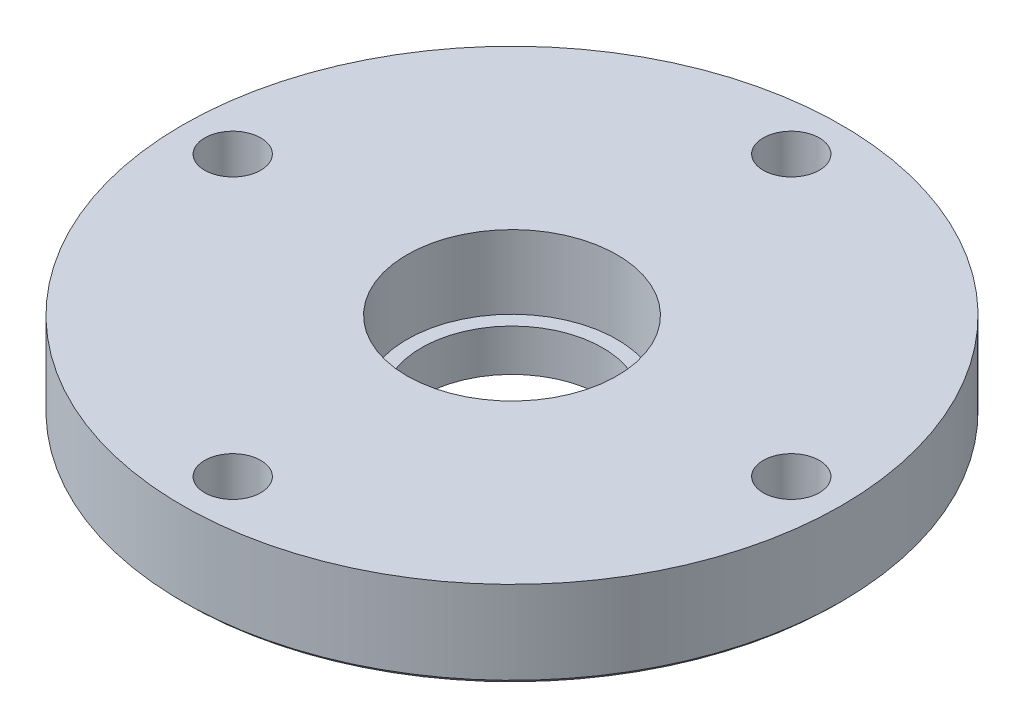
ISO-10303-21;
HEADER;
FILE_DESCRIPTION(('STEP AP214'),'2;1');
FILE_NAME('part.step','',(''),(''),'','','');
FILE_SCHEMA(('AUTOMOTIVE_DESIGN { 1 0 10303 214 1 1 1 1 }'));
ENDSEC;
DATA;
#1=APPLICATION_CONTEXT('core data for automotive mechanical design processes');
#2=APPLICATION_PROTOCOL_DEFINITION('international standard','automotive_design',2000,#1);
#3=PRODUCT_CONTEXT('',#1,'mechanical');
#4=PRODUCT('Part','Part','',(#3));
#5=PRODUCT_RELATED_PRODUCT_CATEGORY('part','',(#4));
#6=PRODUCT_DEFINITION_FORMATION('','',#4);
#7=PRODUCT_DEFINITION_CONTEXT('part definition',#1,'design');
#8=PRODUCT_DEFINITION('design','',#6,#7);
#9=PRODUCT_DEFINITION_SHAPE('','',#8);
#10=(LENGTH_UNIT() NAMED_UNIT(*) SI_UNIT(.MILLI.,.METRE.));
#11=(NAMED_UNIT(*) PLANE_ANGLE_UNIT() SI_UNIT($,.RADIAN.));
#12=(NAMED_UNIT(*) SI_UNIT($,.STERADIAN.) SOLID_ANGLE_UNIT());
#13=UNCERTAINTY_MEASURE_WITH_UNIT(LENGTH_MEASURE(1.E-05),#10,'distance_accuracy_value','');
#14=(GEOMETRIC_REPRESENTATION_CONTEXT(3) GLOBAL_UNCERTAINTY_ASSIGNED_CONTEXT((#13)) GLOBAL_UNIT_ASSIGNED_CONTEXT((#10,
#11,#12)) REPRESENTATION_CONTEXT('',''));
#15=CARTESIAN_POINT('',(0.,0.,0.));
#16=DIRECTION('',(0.,0.,1.));
#17=DIRECTION('',(1.,0.,0.));
#18=AXIS2_PLACEMENT_3D('',#15,#16,#17);
#19=CARTESIAN_POINT('',(0.,0.381000000000019,0.));
#20=DIRECTION('',(0.,1.,0.));
#21=DIRECTION('',(-1.,0.,0.));
#22=AXIS2_PLACEMENT_3D('',#19,#20,#21);
#23=CONICAL_SURFACE('',#22,29.972,0.78539816339745);
#24=CARTESIAN_POINT('',(0.,0.,0.));
#25=DIRECTION('',(0.,1.,0.));
#26=DIRECTION('',(-1.,0.,0.));
#27=AXIS2_PLACEMENT_3D('',#24,#25,#26);
#28=CIRCLE('',#27,29.5909999999999);
#29=CARTESIAN_POINT('',(-29.5909999999999,0.,0.));
#30=VERTEX_POINT('',#29);
#31=EDGE_CURVE('E39',#30,#30,#28,.T.);
#32=ORIENTED_EDGE('',*,*,#31,.T.);
#33=EDGE_LOOP('',(#32));
#34=FACE_BOUND('',#33,.T.);
#35=CARTESIAN_POINT('',(0.,0.381000000000019,0.));
#36=DIRECTION('',(0.,1.,0.));
#37=DIRECTION('',(-1.,0.,0.));
#38=AXIS2_PLACEMENT_3D('',#35,#36,#37);
#39=CIRCLE('',#38,29.972);
#40=CARTESIAN_POINT('',(-29.972,0.381000000000019,0.));
#41=VERTEX_POINT('',#40);
#42=EDGE_CURVE('E49',#41,#41,#39,.T.);
#43=ORIENTED_EDGE('',*,*,#42,.F.);
#44=EDGE_LOOP('',(#43));
#45=FACE_BOUND('',#44,.T.);
#46=ADVANCED_FACE('F32',(#34,#45),#23,.T.);
#47=CARTESIAN_POINT('',(29.5909999999999,0.,0.));
#48=DIRECTION('',(0.,-1.,0.));
#49=DIRECTION('',(1.,0.,0.));
#50=AXIS2_PLACEMENT_3D('',#47,#48,#49);
#51=PLANE('',#50);
#52=CARTESIAN_POINT('',(0.,0.,-25.4));
#53=DIRECTION('',(0.,-1.,0.));
#54=DIRECTION('',(1.,0.,0.));
#55=AXIS2_PLACEMENT_3D('',#52,#53,#54);
#56=CIRCLE('',#55,2.55270000000001);
#57=CARTESIAN_POINT('',(2.55270000000001,0.,-25.4));
#58=VERTEX_POINT('',#57);
#59=EDGE_CURVE('E87',#58,#58,#56,.T.);
#60=ORIENTED_EDGE('',*,*,#59,.F.);
#61=EDGE_LOOP('',(#60));
#62=FACE_BOUND('',#61,.T.);
#63=CARTESIAN_POINT('',(25.4,0.,0.));
#64=DIRECTION('',(0.,-1.,0.));
#65=DIRECTION('',(1.,0.,0.));
#66=AXIS2_PLACEMENT_3D('',#63,#64,#65);
#67=CIRCLE('',#66,2.55270000000001);
#68=CARTESIAN_POINT('',(27.9527,0.,0.));
#69=VERTEX_POINT('',#68);
#70=EDGE_CURVE('E35',#69,#69,#67,.T.);
#71=ORIENTED_EDGE('',*,*,#70,.F.);
#72=EDGE_LOOP('',(#71));
#73=FACE_BOUND('',#72,.T.);
#74=CARTESIAN_POINT('',(-25.4,0.,0.));
#75=DIRECTION('',(0.,-1.,0.));
#76=DIRECTION('',(1.,0.,0.));
#77=AXIS2_PLACEMENT_3D('',#74,#75,#76);
#78=CIRCLE('',#77,2.55270000000001);
#79=CARTESIAN_POINT('',(-22.8473,0.,0.));
#80=VERTEX_POINT('',#79);
#81=EDGE_CURVE('E94',#80,#80,#78,.T.);
#82=ORIENTED_EDGE('',*,*,#81,.F.);
#83=EDGE_LOOP('',(#82));
#84=FACE_BOUND('',#83,.T.);
#85=CARTESIAN_POINT('',(0.,0.,25.4));
#86=DIRECTION('',(0.,-1.,0.));
#87=DIRECTION('',(0.,0.,-1.));
#88=AXIS2_PLACEMENT_3D('',#85,#86,#87);
#89=CIRCLE('',#88,2.55270000000001);
#90=CARTESIAN_POINT('',(0.,0.,22.8473));
#91=VERTEX_POINT('',#90);
#92=EDGE_CURVE('E98',#91,#91,#89,.T.);
#93=ORIENTED_EDGE('',*,*,#92,.F.);
#94=EDGE_LOOP('',(#93));
#95=FACE_BOUND('',#94,.T.);
#96=CARTESIAN_POINT('',(0.,0.,0.));
#97=DIRECTION('',(0.,-1.,0.));
#98=DIRECTION('',(1.,0.,0.));
#99=AXIS2_PLACEMENT_3D('',#96,#97,#98);
#100=CIRCLE('',#99,9.50595);
#101=CARTESIAN_POINT('',(9.50595,0.,0.));
#102=VERTEX_POINT('',#101);
#103=EDGE_CURVE('E10',#102,#102,#100,.T.);
#104=ORIENTED_EDGE('',*,*,#103,.F.);
#105=EDGE_LOOP('',(#104));
#106=FACE_BOUND('',#105,.T.);
#107=ORIENTED_EDGE('',*,*,#31,.F.);
#108=EDGE_LOOP('',(#107));
#109=FACE_BOUND('',#108,.T.);
#110=ADVANCED_FACE('F69',(#62,#73,#84,#95,#106,#109),#51,.T.);
#111=CARTESIAN_POINT('',(0.,7.9375,0.));
#112=DIRECTION('',(0.,1.,0.));
#113=DIRECTION('',(-1.,0.,0.));
#114=AXIS2_PLACEMENT_3D('',#111,#112,#113);
#115=PLANE('',#114);
#116=CARTESIAN_POINT('',(0.,7.9375,0.));
#117=DIRECTION('',(0.,1.,0.));
#118=DIRECTION('',(0.,0.,1.));
#119=AXIS2_PLACEMENT_3D('',#116,#117,#118);
#120=CIRCLE('',#119,9.5504);
#121=CARTESIAN_POINT('',(0.,7.9375,9.5504));
#122=VERTEX_POINT('',#121);
#123=EDGE_CURVE('E159',#122,#122,#120,.T.);
#124=ORIENTED_EDGE('',*,*,#123,.F.);
#125=EDGE_LOOP('',(#124));
#126=FACE_BOUND('',#125,.T.);
#127=CARTESIAN_POINT('',(0.,7.9375,-25.4));
#128=DIRECTION('',(0.,1.,0.));
#129=DIRECTION('',(0.,0.,1.));
#130=AXIS2_PLACEMENT_3D('',#127,#128,#129);
#131=CIRCLE('',#130,2.55270000000001);
#132=CARTESIAN_POINT('',(0.,7.9375,-22.8473));
#133=VERTEX_POINT('',#132);
#134=EDGE_CURVE('E169',#133,#133,#131,.T.);
#135=ORIENTED_EDGE('',*,*,#134,.F.);
#136=EDGE_LOOP('',(#135));
#137=FACE_BOUND('',#136,.T.);
#138=CARTESIAN_POINT('',(25.4,7.9375,0.));
#139=DIRECTION('',(0.,1.,0.));
#140=DIRECTION('',(0.,0.,1.));
#141=AXIS2_PLACEMENT_3D('',#138,#139,#140);
#142=CIRCLE('',#141,2.55270000000001);
#143=CARTESIAN_POINT('',(25.4,7.9375,2.55270000000001));
#144=VERTEX_POINT('',#143);
#145=EDGE_CURVE('E173',#144,#144,#142,.T.);
#146=ORIENTED_EDGE('',*,*,#145,.F.);
#147=EDGE_LOOP('',(#146));
#148=FACE_BOUND('',#147,.T.);
#149=CARTESIAN_POINT('',(-25.4,7.9375,0.));
#150=DIRECTION('',(0.,1.,0.));
#151=DIRECTION('',(0.,0.,1.));
#152=AXIS2_PLACEMENT_3D('',#149,#150,#151);
#153=CIRCLE('',#152,2.55270000000001);
#154=CARTESIAN_POINT('',(-25.4,7.9375,2.55270000000001));
#155=VERTEX_POINT('',#154);
#156=EDGE_CURVE('E105',#155,#155,#153,.T.);
#157=ORIENTED_EDGE('',*,*,#156,.F.);
#158=EDGE_LOOP('',(#157));
#159=FACE_BOUND('',#158,.T.);
#160=CARTESIAN_POINT('',(0.,7.9375,25.4));
#161=DIRECTION('',(0.,-1.,0.));
#162=DIRECTION('',(0.,0.,-1.));
#163=AXIS2_PLACEMENT_3D('',#160,#161,#162);
#164=CIRCLE('',#163,2.55270000000001);
#165=CARTESIAN_POINT('',(0.,7.9375,22.8473));
#166=VERTEX_POINT('',#165);
#167=EDGE_CURVE('E100',#166,#166,#164,.T.);
#168=ORIENTED_EDGE('',*,*,#167,.T.);
#169=EDGE_LOOP('',(#168));
#170=FACE_BOUND('',#169,.T.);
#171=CARTESIAN_POINT('',(0.,7.9375,0.));
#172=DIRECTION('',(0.,1.,0.));
#173=DIRECTION('',(-1.,0.,0.));
#174=AXIS2_PLACEMENT_3D('',#171,#172,#173);
#175=CIRCLE('',#174,29.972);
#176=CARTESIAN_POINT('',(-29.972,7.9375,0.));
#177=VERTEX_POINT('',#176);
#178=EDGE_CURVE('E44',#177,#177,#175,.T.);
#179=ORIENTED_EDGE('',*,*,#178,.T.);
#180=EDGE_LOOP('',(#179));
#181=FACE_BOUND('',#180,.T.);
#182=ADVANCED_FACE('F55',(#126,#137,#148,#159,#170,#181),#115,.T.);
#183=CARTESIAN_POINT('',(0.,0.,0.));
#184=DIRECTION('',(0.,1.,0.));
#185=DIRECTION('',(-1.,0.,0.));
#186=AXIS2_PLACEMENT_3D('',#183,#184,#185);
#187=CYLINDRICAL_SURFACE('',#186,29.972);
#188=ORIENTED_EDGE('',*,*,#42,.T.);
#189=EDGE_LOOP('',(#188));
#190=FACE_BOUND('',#189,.T.);
#191=ORIENTED_EDGE('',*,*,#178,.F.);
#192=EDGE_LOOP('',(#191));
#193=FACE_BOUND('',#192,.T.);
#194=ADVANCED_FACE('F57',(#190,#193),#187,.T.);
#195=CARTESIAN_POINT('',(0.,-2.159,0.));
#196=DIRECTION('',(0.,1.,0.));
#197=DIRECTION('',(-1.,0.,0.));
#198=AXIS2_PLACEMENT_3D('',#195,#196,#197);
#199=CYLINDRICAL_SURFACE('',#198,9.50595);
#200=CARTESIAN_POINT('',(0.,-2.159,0.));
#201=DIRECTION('',(0.,-1.,0.));
#202=DIRECTION('',(1.,0.,0.));
#203=AXIS2_PLACEMENT_3D('',#200,#201,#202);
#204=CIRCLE('',#203,9.50595);
#205=CARTESIAN_POINT('',(9.50595,-2.159,0.));
#206=VERTEX_POINT('',#205);
#207=EDGE_CURVE('E47',#206,#206,#204,.T.);
#208=ORIENTED_EDGE('',*,*,#207,.F.);
#209=EDGE_LOOP('',(#208));
#210=FACE_BOUND('',#209,.T.);
#211=ORIENTED_EDGE('',*,*,#103,.T.);
#212=EDGE_LOOP('',(#211));
#213=FACE_BOUND('',#212,.T.);
#214=ADVANCED_FACE('F59',(#210,#213),#199,.T.);
#215=CARTESIAN_POINT('',(0.,-2.159,0.));
#216=DIRECTION('',(0.,1.,0.));
#217=DIRECTION('',(1.,0.,0.));
#218=AXIS2_PLACEMENT_3D('',#215,#216,#217);
#219=CONICAL_SURFACE('',#218,9.50595,0.785398163397443);
#220=CARTESIAN_POINT('',(0.,-2.54,0.));
#221=DIRECTION('',(0.,-1.,0.));
#222=DIRECTION('',(1.,0.,0.));
#223=AXIS2_PLACEMENT_3D('',#220,#221,#222);
#224=CIRCLE('',#223,9.12495000000001);
#225=CARTESIAN_POINT('',(9.12495000000001,-2.54,0.));
#226=VERTEX_POINT('',#225);
#227=EDGE_CURVE('E103',#226,#226,#224,.T.);
#228=ORIENTED_EDGE('',*,*,#227,.F.);
#229=EDGE_LOOP('',(#228));
#230=FACE_BOUND('',#229,.T.);
#231=ORIENTED_EDGE('',*,*,#207,.T.);
#232=EDGE_LOOP('',(#231));
#233=FACE_BOUND('',#232,.T.);
#234=ADVANCED_FACE('F66',(#230,#233),#219,.T.);
#235=CARTESIAN_POINT('',(0.,-2.54,0.));
#236=DIRECTION('',(0.,-1.,0.));
#237=DIRECTION('',(1.,0.,0.));
#238=AXIS2_PLACEMENT_3D('',#235,#236,#237);
#239=PLANE('',#238);
#240=CARTESIAN_POINT('',(0.,-2.54,0.));
#241=DIRECTION('',(0.,1.,0.));
#242=DIRECTION('',(0.,0.,1.));
#243=AXIS2_PLACEMENT_3D('',#240,#241,#242);
#244=CIRCLE('',#243,8.23595000000001);
#245=CARTESIAN_POINT('',(0.,-2.54,8.23595000000001));
#246=VERTEX_POINT('',#245);
#247=EDGE_CURVE('E166',#246,#246,#244,.T.);
#248=ORIENTED_EDGE('',*,*,#247,.T.);
#249=EDGE_LOOP('',(#248));
#250=FACE_BOUND('',#249,.T.);
#251=ORIENTED_EDGE('',*,*,#227,.T.);
#252=EDGE_LOOP('',(#251));
#253=FACE_BOUND('',#252,.T.);
#254=ADVANCED_FACE('F115',(#250,#253),#239,.T.);
#255=CARTESIAN_POINT('',(0.,0.,25.4));
#256=DIRECTION('',(0.,-1.,0.));
#257=DIRECTION('',(0.,0.,-1.));
#258=AXIS2_PLACEMENT_3D('',#255,#256,#257);
#259=CYLINDRICAL_SURFACE('',#258,2.55270000000001);
#260=ORIENTED_EDGE('',*,*,#167,.F.);
#261=EDGE_LOOP('',(#260));
#262=FACE_BOUND('',#261,.T.);
#263=ORIENTED_EDGE('',*,*,#92,.T.);
#264=EDGE_LOOP('',(#263));
#265=FACE_BOUND('',#264,.T.);
#266=ADVANCED_FACE('F121',(#262,#265),#259,.F.);
#267=CARTESIAN_POINT('',(-25.4,7.9375,0.));
#268=DIRECTION('',(0.,1.,0.));
#269=DIRECTION('',(0.,0.,1.));
#270=AXIS2_PLACEMENT_3D('',#267,#268,#269);
#271=CYLINDRICAL_SURFACE('',#270,2.55270000000001);
#272=ORIENTED_EDGE('',*,*,#81,.T.);
#273=EDGE_LOOP('',(#272));
#274=FACE_BOUND('',#273,.T.);
#275=ORIENTED_EDGE('',*,*,#156,.T.);
#276=EDGE_LOOP('',(#275));
#277=FACE_BOUND('',#276,.T.);
#278=ADVANCED_FACE('F127',(#274,#277),#271,.F.);
#279=CARTESIAN_POINT('',(25.4,7.9375,0.));
#280=DIRECTION('',(0.,1.,0.));
#281=DIRECTION('',(0.,0.,1.));
#282=AXIS2_PLACEMENT_3D('',#279,#280,#281);
#283=CYLINDRICAL_SURFACE('',#282,2.55270000000001);
#284=ORIENTED_EDGE('',*,*,#70,.T.);
#285=EDGE_LOOP('',(#284));
#286=FACE_BOUND('',#285,.T.);
#287=ORIENTED_EDGE('',*,*,#145,.T.);
#288=EDGE_LOOP('',(#287));
#289=FACE_BOUND('',#288,.T.);
#290=ADVANCED_FACE('F131',(#286,#289),#283,.F.);
#291=CARTESIAN_POINT('',(0.,7.9375,-25.4));
#292=DIRECTION('',(0.,1.,0.));
#293=DIRECTION('',(0.,0.,1.));
#294=AXIS2_PLACEMENT_3D('',#291,#292,#293);
#295=CYLINDRICAL_SURFACE('',#294,2.55270000000001);
#296=ORIENTED_EDGE('',*,*,#59,.T.);
#297=EDGE_LOOP('',(#296));
#298=FACE_BOUND('',#297,.T.);
#299=ORIENTED_EDGE('',*,*,#134,.T.);
#300=EDGE_LOOP('',(#299));
#301=FACE_BOUND('',#300,.T.);
#302=ADVANCED_FACE('F135',(#298,#301),#295,.F.);
#303=CARTESIAN_POINT('',(0.,7.9375,0.));
#304=DIRECTION('',(0.,1.,0.));
#305=DIRECTION('',(0.,0.,1.));
#306=AXIS2_PLACEMENT_3D('',#303,#304,#305);
#307=CYLINDRICAL_SURFACE('',#306,8.23595000000001);
#308=ORIENTED_EDGE('',*,*,#247,.F.);
#309=EDGE_LOOP('',(#308));
#310=FACE_BOUND('',#309,.T.);
#311=CARTESIAN_POINT('',(0.,1.27,0.));
#312=DIRECTION('',(0.,1.,0.));
#313=DIRECTION('',(0.,0.,1.));
#314=AXIS2_PLACEMENT_3D('',#311,#312,#313);
#315=CIRCLE('',#314,8.23595000000001);
#316=CARTESIAN_POINT('',(0.,1.27,8.23595000000001));
#317=VERTEX_POINT('',#316);
#318=EDGE_CURVE('E161',#317,#317,#315,.T.);
#319=ORIENTED_EDGE('',*,*,#318,.T.);
#320=EDGE_LOOP('',(#319));
#321=FACE_BOUND('',#320,.T.);
#322=ADVANCED_FACE('F139',(#310,#321),#307,.F.);
#323=CARTESIAN_POINT('',(8.23595000000001,1.27,0.));
#324=DIRECTION('',(0.,-1.,0.));
#325=DIRECTION('',(0.,0.,-1.));
#326=AXIS2_PLACEMENT_3D('',#323,#324,#325);
#327=PLANE('',#326);
#328=ORIENTED_EDGE('',*,*,#318,.F.);
#329=EDGE_LOOP('',(#328));
#330=FACE_BOUND('',#329,.T.);
#331=CARTESIAN_POINT('',(0.,1.27,0.));
#332=DIRECTION('',(0.,1.,0.));
#333=DIRECTION('',(0.,0.,1.));
#334=AXIS2_PLACEMENT_3D('',#331,#332,#333);
#335=CIRCLE('',#334,9.5504);
#336=CARTESIAN_POINT('',(0.,1.27,9.5504));
#337=VERTEX_POINT('',#336);
#338=EDGE_CURVE('E156',#337,#337,#335,.T.);
#339=ORIENTED_EDGE('',*,*,#338,.T.);
#340=EDGE_LOOP('',(#339));
#341=FACE_BOUND('',#340,.T.);
#342=ADVANCED_FACE('F143',(#330,#341),#327,.F.);
#343=CARTESIAN_POINT('',(0.,7.9375,0.));
#344=DIRECTION('',(0.,1.,0.));
#345=DIRECTION('',(0.,0.,1.));
#346=AXIS2_PLACEMENT_3D('',#343,#344,#345);
#347=CYLINDRICAL_SURFACE('',#346,9.5504);
#348=ORIENTED_EDGE('',*,*,#338,.F.);
#349=EDGE_LOOP('',(#348));
#350=FACE_BOUND('',#349,.T.);
#351=ORIENTED_EDGE('',*,*,#123,.T.);
#352=EDGE_LOOP('',(#351));
#353=FACE_BOUND('',#352,.T.);
#354=ADVANCED_FACE('F147',(#350,#353),#347,.F.);
#355=CLOSED_SHELL('',(#46,#110,#182,#194,#214,#234,#254,#266,#278,#290,#302,#322,#342,#354));
#356=MANIFOLD_SOLID_BREP('B2',#355);
#357=ADVANCED_BREP_SHAPE_REPRESENTATION('',(#18,#356),#14);
#358=SHAPE_DEFINITION_REPRESENTATION(#9,#357);
ENDSEC;
END-ISO-10303-21;
